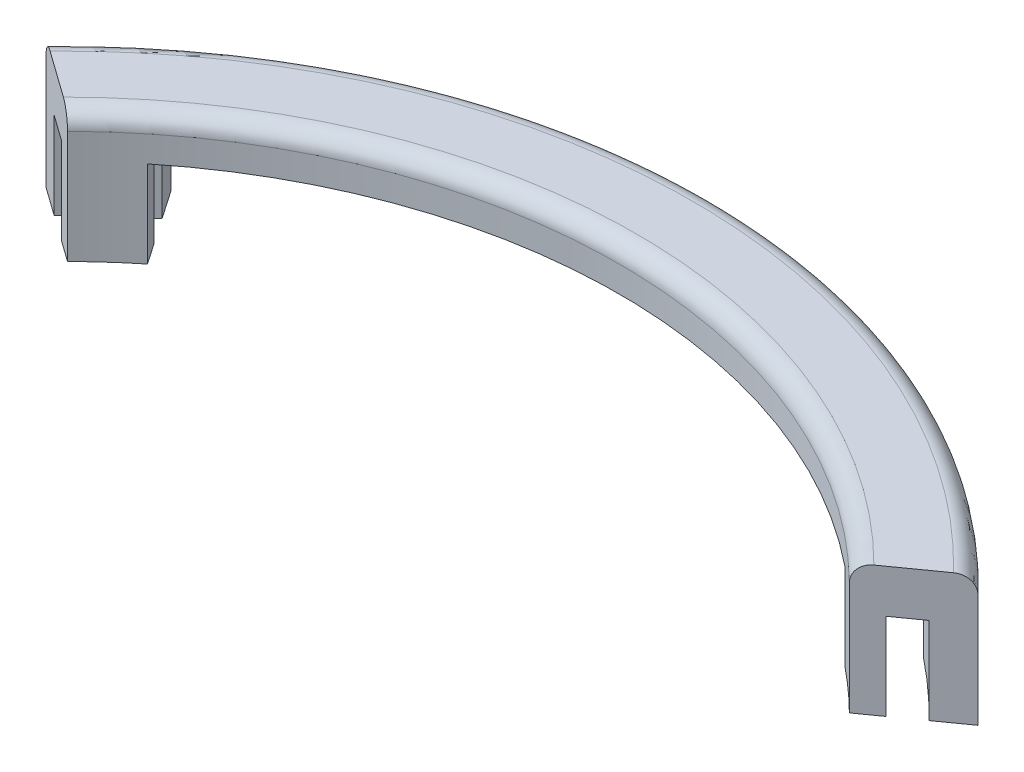
ISO-10303-21;
HEADER;
FILE_DESCRIPTION(('STEP AP214'),'2;1');
FILE_NAME('part.step','',(''),(''),'','','');
FILE_SCHEMA(('AUTOMOTIVE_DESIGN { 1 0 10303 214 1 1 1 1 }'));
ENDSEC;
DATA;
#1=APPLICATION_CONTEXT('core data for automotive mechanical design processes');
#2=APPLICATION_PROTOCOL_DEFINITION('international standard','automotive_design',2000,#1);
#3=PRODUCT_CONTEXT('',#1,'mechanical');
#4=PRODUCT('Part','Part','',(#3));
#5=PRODUCT_RELATED_PRODUCT_CATEGORY('part','',(#4));
#6=PRODUCT_DEFINITION_FORMATION('','',#4);
#7=PRODUCT_DEFINITION_CONTEXT('part definition',#1,'design');
#8=PRODUCT_DEFINITION('design','',#6,#7);
#9=PRODUCT_DEFINITION_SHAPE('','',#8);
#10=(LENGTH_UNIT() NAMED_UNIT(*) SI_UNIT(.MILLI.,.METRE.));
#11=(NAMED_UNIT(*) PLANE_ANGLE_UNIT() SI_UNIT($,.RADIAN.));
#12=(NAMED_UNIT(*) SI_UNIT($,.STERADIAN.) SOLID_ANGLE_UNIT());
#13=UNCERTAINTY_MEASURE_WITH_UNIT(LENGTH_MEASURE(1.E-05),#10,'distance_accuracy_value','');
#14=(GEOMETRIC_REPRESENTATION_CONTEXT(3) GLOBAL_UNCERTAINTY_ASSIGNED_CONTEXT((#13)) GLOBAL_UNIT_ASSIGNED_CONTEXT((#10,
#11,#12)) REPRESENTATION_CONTEXT('',''));
#15=CARTESIAN_POINT('',(0.,0.,0.));
#16=DIRECTION('',(0.,0.,1.));
#17=DIRECTION('',(1.,0.,0.));
#18=AXIS2_PLACEMENT_3D('',#15,#16,#17);
#19=CARTESIAN_POINT('',(0.,0.,0.));
#20=DIRECTION('',(0.,-1.,0.));
#21=DIRECTION('',(0.,0.,-1.));
#22=AXIS2_PLACEMENT_3D('',#19,#20,#21);
#23=PLANE('',#22);
#24=CARTESIAN_POINT('',(0.,0.,0.));
#25=DIRECTION('',(0.,-1.,0.));
#26=DIRECTION('',(0.,0.,-1.));
#27=AXIS2_PLACEMENT_3D('',#24,#25,#26);
#28=CIRCLE('',#27,89.535);
#29=CARTESIAN_POINT('',(55.744972969935,0.,-70.0643576548106));
#30=VERTEX_POINT('',#29);
#31=CARTESIAN_POINT('',(64.0434533645431,0.,-62.569579718451));
#32=VERTEX_POINT('',#31);
#33=EDGE_CURVE('E338',#30,#32,#28,.T.);
#34=ORIENTED_EDGE('',*,*,#33,.F.);
#35=DIRECTION('',(0.566292783903037,0.,-0.824204151226714));
#36=VECTOR('',#35,1.);
#37=CARTESIAN_POINT('',(5.16635721881408,0.,3.54969191519518));
#38=LINE('',#37,#36);
#39=CARTESIAN_POINT('',(58.6284350981099,0.,-74.2610585902647));
#40=VERTEX_POINT('',#39);
#41=EDGE_CURVE('E549',#30,#40,#38,.T.);
#42=ORIENTED_EDGE('',*,*,#41,.T.);
#43=CARTESIAN_POINT('',(0.,0.,0.));
#44=DIRECTION('',(0.,1.,0.));
#45=DIRECTION('',(0.,0.,-1.));
#46=AXIS2_PLACEMENT_3D('',#43,#44,#45);
#47=CIRCLE('',#46,94.615);
#48=CARTESIAN_POINT('',(68.2255935502987,0.,-65.5535400242385));
#49=VERTEX_POINT('',#48);
#50=EDGE_CURVE('E193',#49,#40,#47,.T.);
#51=ORIENTED_EDGE('',*,*,#50,.F.);
#52=DIRECTION('',(0.814035572170162,0.,-0.580815019814052));
#53=VECTOR('',#52,1.);
#54=CARTESIAN_POINT('',(57.2347353310245,0.,-57.7115540562509));
#55=LINE('',#54,#53);
#56=EDGE_CURVE('E213',#32,#49,#55,.T.);
#57=ORIENTED_EDGE('',*,*,#56,.F.);
#58=EDGE_LOOP('',(#34,#42,#51,#57));
#59=FACE_BOUND('',#58,.T.);
#60=ADVANCED_FACE('F38',(#59),#23,.T.);
#61=CARTESIAN_POINT('',(-58.6284350981098,0.,-74.2610585902647));
#62=VERTEX_POINT('',#61);
#63=CARTESIAN_POINT('',(-68.2255935502987,0.,-65.5535400242385));
#64=VERTEX_POINT('',#63);
#65=EDGE_CURVE('E181',#62,#64,#47,.T.);
#66=ORIENTED_EDGE('',*,*,#65,.F.);
#67=DIRECTION('',(0.566292783903031,0.,0.824204151226719));
#68=VECTOR('',#67,1.);
#69=CARTESIAN_POINT('',(-5.16635721881463,0.,3.5496919151955));
#70=LINE('',#69,#68);
#71=CARTESIAN_POINT('',(-55.7449729699349,0.,-70.0643576548106));
#72=VERTEX_POINT('',#71);
#73=EDGE_CURVE('E162',#62,#72,#70,.T.);
#74=ORIENTED_EDGE('',*,*,#73,.T.);
#75=CARTESIAN_POINT('',(-64.0434533645431,0.,-62.569579718451));
#76=VERTEX_POINT('',#75);
#77=EDGE_CURVE('E332',#76,#72,#28,.T.);
#78=ORIENTED_EDGE('',*,*,#77,.F.);
#79=DIRECTION('',(0.814035572170162,0.,0.580815019814052));
#80=VECTOR('',#79,1.);
#81=CARTESIAN_POINT('',(-57.2347353310245,0.,-57.7115540562509));
#82=LINE('',#81,#80);
#83=EDGE_CURVE('E191',#64,#76,#82,.T.);
#84=ORIENTED_EDGE('',*,*,#83,.F.);
#85=EDGE_LOOP('',(#66,#74,#78,#84));
#86=FACE_BOUND('',#85,.T.);
#87=ADVANCED_FACE('F189',(#86),#23,.T.);
#88=CARTESIAN_POINT('',(0.,19.05,0.));
#89=DIRECTION('',(0.,-1.,0.));
#90=DIRECTION('',(0.,0.,-1.));
#91=AXIS2_PLACEMENT_3D('',#88,#89,#90);
#92=CYLINDRICAL_SURFACE('',#91,94.615);
#93=DIRECTION('',(0.,-1.,0.));
#94=VECTOR('',#93,1.);
#95=CARTESIAN_POINT('',(58.6284350981099,19.05,-74.2610585902647));
#96=LINE('',#95,#94);
#97=CARTESIAN_POINT('',(58.6284350981099,12.7,-74.2610585902647));
#98=VERTEX_POINT('',#97);
#99=EDGE_CURVE('E391',#98,#40,#96,.T.);
#100=ORIENTED_EDGE('',*,*,#99,.F.);
#101=CARTESIAN_POINT('',(0.,12.7,0.));
#102=DIRECTION('',(0.,1.,0.));
#103=DIRECTION('',(0.,0.,1.));
#104=AXIS2_PLACEMENT_3D('',#101,#102,#103);
#105=CIRCLE('',#104,94.615);
#106=CARTESIAN_POINT('',(-58.6284350981098,12.7,-74.2610585902647));
#107=VERTEX_POINT('',#106);
#108=EDGE_CURVE('E183',#98,#107,#105,.T.);
#109=ORIENTED_EDGE('',*,*,#108,.T.);
#110=DIRECTION('',(0.,-1.,0.));
#111=VECTOR('',#110,1.);
#112=CARTESIAN_POINT('',(-58.6284350981098,19.05,-74.2610585902647));
#113=LINE('',#112,#111);
#114=EDGE_CURVE('E165',#62,#107,#113,.F.);
#115=ORIENTED_EDGE('',*,*,#114,.F.);
#116=ORIENTED_EDGE('',*,*,#65,.T.);
#117=DIRECTION('',(0.,-1.,0.));
#118=VECTOR('',#117,1.);
#119=CARTESIAN_POINT('',(-68.2255935502987,19.05,-65.5535400242385));
#120=LINE('',#119,#118);
#121=CARTESIAN_POINT('',(-68.2255935502987,16.51,-65.5535400242385));
#122=VERTEX_POINT('',#121);
#123=EDGE_CURVE('E229',#122,#64,#120,.T.);
#124=ORIENTED_EDGE('',*,*,#123,.F.);
#125=CARTESIAN_POINT('',(0.,16.51,0.));
#126=DIRECTION('',(0.,-1.,0.));
#127=DIRECTION('',(0.,0.,-1.));
#128=AXIS2_PLACEMENT_3D('',#125,#126,#127);
#129=CIRCLE('',#128,94.615);
#130=CARTESIAN_POINT('',(68.2255935502987,16.51,-65.5535400242385));
#131=VERTEX_POINT('',#130);
#132=EDGE_CURVE('E11',#122,#131,#129,.T.);
#133=ORIENTED_EDGE('',*,*,#132,.T.);
#134=DIRECTION('',(0.,-1.,0.));
#135=VECTOR('',#134,1.);
#136=CARTESIAN_POINT('',(68.2255935502987,19.05,-65.5535400242385));
#137=LINE('',#136,#135);
#138=EDGE_CURVE('E219',#131,#49,#137,.T.);
#139=ORIENTED_EDGE('',*,*,#138,.T.);
#140=ORIENTED_EDGE('',*,*,#50,.T.);
#141=EDGE_LOOP('',(#100,#109,#115,#116,#124,#133,#139,#140));
#142=FACE_BOUND('',#141,.T.);
#143=ADVANCED_FACE('F179',(#142),#92,.T.);
#144=CARTESIAN_POINT('',(0.,19.05,0.));
#145=DIRECTION('',(0.,-1.,0.));
#146=DIRECTION('',(0.,0.,-1.));
#147=AXIS2_PLACEMENT_3D('',#144,#145,#146);
#148=CYLINDRICAL_SURFACE('',#147,81.28);
#149=DIRECTION('',(0.,-1.,0.));
#150=VECTOR('',#149,1.);
#151=CARTESIAN_POINT('',(51.0575547917866,19.05,-63.242110169441));
#152=LINE('',#151,#150);
#153=CARTESIAN_POINT('',(51.0575547917866,0.,-63.242110169441));
#154=VERTEX_POINT('',#153);
#155=CARTESIAN_POINT('',(51.0575547917866,12.7,-63.242110169441));
#156=VERTEX_POINT('',#155);
#157=EDGE_CURVE('E388',#154,#156,#152,.F.);
#158=ORIENTED_EDGE('',*,*,#157,.F.);
#159=CARTESIAN_POINT('',(0.,0.,0.));
#160=DIRECTION('',(0.,-1.,0.));
#161=DIRECTION('',(0.,0.,-1.));
#162=AXIS2_PLACEMENT_3D('',#159,#160,#161);
#163=CIRCLE('',#162,81.28);
#164=CARTESIAN_POINT('',(57.2347353310245,0.,-57.711554056251));
#165=VERTEX_POINT('',#164);
#166=EDGE_CURVE('E208',#154,#165,#163,.T.);
#167=ORIENTED_EDGE('',*,*,#166,.T.);
#168=DIRECTION('',(0.,-1.,0.));
#169=VECTOR('',#168,1.);
#170=CARTESIAN_POINT('',(57.2347353310245,19.05,-57.711554056251));
#171=LINE('',#170,#169);
#172=CARTESIAN_POINT('',(57.2347353310245,16.51,-57.711554056251));
#173=VERTEX_POINT('',#172);
#174=EDGE_CURVE('E222',#173,#165,#171,.T.);
#175=ORIENTED_EDGE('',*,*,#174,.F.);
#176=CARTESIAN_POINT('',(0.,16.51,0.));
#177=DIRECTION('',(0.,-1.,0.));
#178=DIRECTION('',(0.,0.,-1.));
#179=AXIS2_PLACEMENT_3D('',#176,#177,#178);
#180=CIRCLE('',#179,81.28);
#181=CARTESIAN_POINT('',(-57.2347353310245,16.51,-57.7115540562509));
#182=VERTEX_POINT('',#181);
#183=EDGE_CURVE('E363',#173,#182,#180,.F.);
#184=ORIENTED_EDGE('',*,*,#183,.T.);
#185=DIRECTION('',(0.,-1.,0.));
#186=VECTOR('',#185,1.);
#187=CARTESIAN_POINT('',(-57.2347353310245,19.05,-57.7115540562509));
#188=LINE('',#187,#186);
#189=CARTESIAN_POINT('',(-57.2347353310245,0.,-57.7115540562509));
#190=VERTEX_POINT('',#189);
#191=EDGE_CURVE('E226',#182,#190,#188,.T.);
#192=ORIENTED_EDGE('',*,*,#191,.T.);
#193=CARTESIAN_POINT('',(-51.0575547917866,0.,-63.242110169441));
#194=VERTEX_POINT('',#193);
#195=EDGE_CURVE('E209',#190,#194,#163,.T.);
#196=ORIENTED_EDGE('',*,*,#195,.T.);
#197=DIRECTION('',(0.,-1.,0.));
#198=VECTOR('',#197,1.);
#199=CARTESIAN_POINT('',(-51.0575547917866,19.05,-63.242110169441));
#200=LINE('',#199,#198);
#201=CARTESIAN_POINT('',(-51.0575547917866,12.7,-63.242110169441));
#202=VERTEX_POINT('',#201);
#203=EDGE_CURVE('E186',#202,#194,#200,.T.);
#204=ORIENTED_EDGE('',*,*,#203,.F.);
#205=CARTESIAN_POINT('',(0.,12.7,0.));
#206=DIRECTION('',(0.,1.,0.));
#207=DIRECTION('',(0.,0.,1.));
#208=AXIS2_PLACEMENT_3D('',#205,#206,#207);
#209=CIRCLE('',#208,81.28);
#210=EDGE_CURVE('E374',#202,#156,#209,.F.);
#211=ORIENTED_EDGE('',*,*,#210,.T.);
#212=EDGE_LOOP('',(#158,#167,#175,#184,#192,#196,#204,#211));
#213=FACE_BOUND('',#212,.T.);
#214=ADVANCED_FACE('F263',(#213),#148,.F.);
#215=ORIENTED_EDGE('',*,*,#166,.F.);
#216=CARTESIAN_POINT('',(53.2212853213504,0.,-66.3912862410679));
#217=VERTEX_POINT('',#216);
#218=EDGE_CURVE('E554',#154,#217,#38,.T.);
#219=ORIENTED_EDGE('',*,*,#218,.T.);
#220=CARTESIAN_POINT('',(0.,0.,0.));
#221=DIRECTION('',(0.,1.,0.));
#222=DIRECTION('',(0.,0.,-1.));
#223=AXIS2_PLACEMENT_3D('',#220,#221,#222);
#224=CIRCLE('',#223,85.09);
#225=CARTESIAN_POINT('',(60.3794057355664,0.,-59.9552788586615));
#226=VERTEX_POINT('',#225);
#227=EDGE_CURVE('E331',#226,#217,#224,.T.);
#228=ORIENTED_EDGE('',*,*,#227,.F.);
#229=EDGE_CURVE('E214',#165,#226,#55,.T.);
#230=ORIENTED_EDGE('',*,*,#229,.F.);
#231=EDGE_LOOP('',(#215,#219,#228,#230));
#232=FACE_BOUND('',#231,.T.);
#233=ADVANCED_FACE('F267',(#232),#23,.T.);
#234=CARTESIAN_POINT('',(-53.2212853213504,0.,-66.3912862410679));
#235=VERTEX_POINT('',#234);
#236=CARTESIAN_POINT('',(-60.3794057355663,0.,-59.9552788586615));
#237=VERTEX_POINT('',#236);
#238=EDGE_CURVE('E323',#235,#237,#224,.T.);
#239=ORIENTED_EDGE('',*,*,#238,.F.);
#240=EDGE_CURVE('E174',#235,#194,#70,.T.);
#241=ORIENTED_EDGE('',*,*,#240,.T.);
#242=ORIENTED_EDGE('',*,*,#195,.F.);
#243=EDGE_CURVE('E199',#237,#190,#82,.T.);
#244=ORIENTED_EDGE('',*,*,#243,.F.);
#245=EDGE_LOOP('',(#239,#241,#242,#244));
#246=FACE_BOUND('',#245,.T.);
#247=ADVANCED_FACE('F303',(#246),#23,.T.);
#248=CARTESIAN_POINT('',(0.,12.7,0.));
#249=DIRECTION('',(0.,-1.,0.));
#250=DIRECTION('',(0.,0.,-1.));
#251=AXIS2_PLACEMENT_3D('',#248,#249,#250);
#252=CYLINDRICAL_SURFACE('',#251,89.535);
#253=DIRECTION('',(0.,-1.,0.));
#254=VECTOR('',#253,1.);
#255=CARTESIAN_POINT('',(55.744972969935,12.7,-70.0643576548106));
#256=LINE('',#255,#254);
#257=CARTESIAN_POINT('',(55.744972969935,12.7,-70.0643576548106));
#258=VERTEX_POINT('',#257);
#259=EDGE_CURVE('E385',#30,#258,#256,.F.);
#260=ORIENTED_EDGE('',*,*,#259,.F.);
#261=ORIENTED_EDGE('',*,*,#33,.T.);
#262=DIRECTION('',(0.,-1.,0.));
#263=VECTOR('',#262,1.);
#264=CARTESIAN_POINT('',(64.0434533645431,12.7,-62.569579718451));
#265=LINE('',#264,#263);
#266=CARTESIAN_POINT('',(64.0434533645431,12.7,-62.569579718451));
#267=VERTEX_POINT('',#266);
#268=EDGE_CURVE('E347',#267,#32,#265,.T.);
#269=ORIENTED_EDGE('',*,*,#268,.F.);
#270=CARTESIAN_POINT('',(0.,12.7,0.));
#271=DIRECTION('',(0.,-1.,0.));
#272=DIRECTION('',(0.,0.,-1.));
#273=AXIS2_PLACEMENT_3D('',#270,#271,#272);
#274=CIRCLE('',#273,89.535);
#275=EDGE_CURVE('E337',#258,#267,#274,.T.);
#276=ORIENTED_EDGE('',*,*,#275,.F.);
#277=EDGE_LOOP('',(#260,#261,#269,#276));
#278=FACE_BOUND('',#277,.T.);
#279=ADVANCED_FACE('F310',(#278),#252,.F.);
#280=DIRECTION('',(0.,-1.,0.));
#281=VECTOR('',#280,1.);
#282=CARTESIAN_POINT('',(-55.7449729699349,12.7,-70.0643576548106));
#283=LINE('',#282,#281);
#284=CARTESIAN_POINT('',(-55.744972969935,12.7,-70.0643576548107));
#285=VERTEX_POINT('',#284);
#286=EDGE_CURVE('E168',#285,#72,#283,.T.);
#287=ORIENTED_EDGE('',*,*,#286,.F.);
#288=CARTESIAN_POINT('',(-64.0434533645431,12.7,-62.569579718451));
#289=VERTEX_POINT('',#288);
#290=EDGE_CURVE('E398',#289,#285,#274,.T.);
#291=ORIENTED_EDGE('',*,*,#290,.F.);
#292=DIRECTION('',(0.,-1.,0.));
#293=VECTOR('',#292,1.);
#294=CARTESIAN_POINT('',(-64.0434533645431,12.7,-62.569579718451));
#295=LINE('',#294,#293);
#296=EDGE_CURVE('E194',#289,#76,#295,.T.);
#297=ORIENTED_EDGE('',*,*,#296,.T.);
#298=ORIENTED_EDGE('',*,*,#77,.T.);
#299=EDGE_LOOP('',(#287,#291,#297,#298));
#300=FACE_BOUND('',#299,.T.);
#301=ADVANCED_FACE('F316',(#300),#252,.F.);
#302=CARTESIAN_POINT('',(0.,12.7,0.));
#303=DIRECTION('',(0.,-1.,0.));
#304=DIRECTION('',(0.,0.,-1.));
#305=AXIS2_PLACEMENT_3D('',#302,#303,#304);
#306=CYLINDRICAL_SURFACE('',#305,85.09);
#307=DIRECTION('',(0.,-1.,0.));
#308=VECTOR('',#307,1.);
#309=CARTESIAN_POINT('',(53.2212853213504,12.7,-66.3912862410679));
#310=LINE('',#309,#308);
#311=CARTESIAN_POINT('',(53.2212853213504,12.7,-66.3912862410679));
#312=VERTEX_POINT('',#311);
#313=EDGE_CURVE('E185',#312,#217,#310,.T.);
#314=ORIENTED_EDGE('',*,*,#313,.F.);
#315=CARTESIAN_POINT('',(0.,12.7,0.));
#316=DIRECTION('',(0.,1.,0.));
#317=DIRECTION('',(0.,0.,-1.));
#318=AXIS2_PLACEMENT_3D('',#315,#316,#317);
#319=CIRCLE('',#318,85.09);
#320=CARTESIAN_POINT('',(60.3794057355663,12.7,-59.9552788586615));
#321=VERTEX_POINT('',#320);
#322=EDGE_CURVE('E407',#321,#312,#319,.T.);
#323=ORIENTED_EDGE('',*,*,#322,.F.);
#324=DIRECTION('',(0.,-1.,0.));
#325=VECTOR('',#324,1.);
#326=CARTESIAN_POINT('',(60.3794057355663,12.7,-59.9552788586615));
#327=LINE('',#326,#325);
#328=EDGE_CURVE('E344',#321,#226,#327,.T.);
#329=ORIENTED_EDGE('',*,*,#328,.T.);
#330=ORIENTED_EDGE('',*,*,#227,.T.);
#331=EDGE_LOOP('',(#314,#323,#329,#330));
#332=FACE_BOUND('',#331,.T.);
#333=ADVANCED_FACE('F417',(#332),#306,.T.);
#334=DIRECTION('',(0.,-1.,0.));
#335=VECTOR('',#334,1.);
#336=CARTESIAN_POINT('',(-53.2212853213504,12.7,-66.3912862410679));
#337=LINE('',#336,#335);
#338=CARTESIAN_POINT('',(-53.2212853213504,12.7,-66.3912862410679));
#339=VERTEX_POINT('',#338);
#340=EDGE_CURVE('E379',#235,#339,#337,.F.);
#341=ORIENTED_EDGE('',*,*,#340,.F.);
#342=ORIENTED_EDGE('',*,*,#238,.T.);
#343=DIRECTION('',(0.,-1.,0.));
#344=VECTOR('',#343,1.);
#345=CARTESIAN_POINT('',(-60.3794057355663,12.7,-59.9552788586615));
#346=LINE('',#345,#344);
#347=CARTESIAN_POINT('',(-60.3794057355663,12.7,-59.9552788586615));
#348=VERTEX_POINT('',#347);
#349=EDGE_CURVE('E200',#348,#237,#346,.T.);
#350=ORIENTED_EDGE('',*,*,#349,.F.);
#351=EDGE_CURVE('E406',#339,#348,#319,.T.);
#352=ORIENTED_EDGE('',*,*,#351,.F.);
#353=EDGE_LOOP('',(#341,#342,#350,#352));
#354=FACE_BOUND('',#353,.T.);
#355=ADVANCED_FACE('F272',(#354),#306,.T.);
#356=CARTESIAN_POINT('',(-57.2347353310245,19.05,-57.7115540562509));
#357=DIRECTION('',(0.580815019814052,0.,-0.814035572170162));
#358=DIRECTION('',(-0.814035572170162,0.,-0.580815019814052));
#359=AXIS2_PLACEMENT_3D('',#356,#357,#358);
#360=PLANE('',#359);
#361=ORIENTED_EDGE('',*,*,#191,.F.);
#362=CARTESIAN_POINT('',(-57.2347353310245,16.51,-57.7115540562509));
#363=CARTESIAN_POINT('',(-57.2347292125334,16.5807027289296,-57.7115496907027));
#364=CARTESIAN_POINT('',(-57.237173461785,16.6514018811038,-57.7132936644626));
#365=CARTESIAN_POINT('',(-57.2469154589435,16.7922884303876,-57.7202445870833));
#366=CARTESIAN_POINT('',(-57.2542128303198,16.8624758667718,-57.7254512672892));
#367=CARTESIAN_POINT('',(-57.2736025490014,17.0017643360062,-57.7392858467908));
#368=CARTESIAN_POINT('',(-57.2856893010382,17.0708665391062,-57.7479097538579));
#369=CARTESIAN_POINT('',(-57.3145521117735,17.2075564949376,-57.7685033919767));
#370=CARTESIAN_POINT('',(-57.331328139965,17.2751442575184,-57.7804731012616));
#371=CARTESIAN_POINT('',(-57.3885344369747,17.4749666658083,-57.8212898390886));
#372=CARTESIAN_POINT('',(-57.4358538106855,17.6043381113576,-57.8550522493801));
#373=CARTESIAN_POINT('',(-57.5473638490288,17.8514867100328,-57.9346147492806));
#374=CARTESIAN_POINT('',(-57.6115535330716,17.969264536493,-57.9804141392382));
#375=CARTESIAN_POINT('',(-57.7553907269823,18.1908514799067,-58.0830420900151));
#376=CARTESIAN_POINT('',(-57.8351345444467,18.2945663658334,-58.1399393663799));
#377=CARTESIAN_POINT('',(-58.0075094791364,18.4843585711963,-58.2629290176065));
#378=CARTESIAN_POINT('',(-58.1001434481603,18.5704319772076,-58.3290234272288));
#379=CARTESIAN_POINT('',(-58.297004126405,18.7237328887879,-58.4694836757047));
#380=CARTESIAN_POINT('',(-58.4013722475935,18.7906861021638,-58.5439504121084));
#381=CARTESIAN_POINT('',(-58.6176848437346,18.9023906695845,-58.6982896192745));
#382=CARTESIAN_POINT('',(-58.7296262860345,18.9471508514795,-58.7781599262368));
#383=CARTESIAN_POINT('',(-58.9236696217515,19.0034225981474,-58.9166099986074));
#384=CARTESIAN_POINT('',(-59.0046645237337,19.0208776014887,-58.974399924758));
#385=CARTESIAN_POINT('',(-59.1676387969249,19.0441658601325,-59.0906821966253));
#386=CARTESIAN_POINT('',(-59.2496166306025,19.0500153566809,-59.1491734453122));
#387=CARTESIAN_POINT('',(-59.33162764036,19.05,-59.2076883651581));
#388=B_SPLINE_CURVE_WITH_KNOTS('',3,(#362,#363,#364,#365,#366,#367,#368,#369,#370,#371,#372,
#373,#374,#375,#376,#377,#378,#379,#380,#381,#382,#383,#384,#385,#386,#387),.UNSPECIFIED.,.F.,
.F.,(4,2,2,2,2,2,2,2,2,2,2,2,4),(0.,0.212038091459266,0.424059733814965,0.635834405439172,
0.84760769935326,1.27092079623805,1.69420929341764,2.12020703134357,2.54629916668803,
2.97822772417059,3.40998433282428,3.71239781108664,4.01438777954809),.UNSPECIFIED.);
#389=CARTESIAN_POINT('',(-59.33162764036,19.05,-59.2076883651581));
#390=VERTEX_POINT('',#389);
#391=EDGE_CURVE('E48',#182,#390,#388,.T.);
#392=ORIENTED_EDGE('',*,*,#391,.T.);
#393=DIRECTION('',(0.814035572170162,0.,0.580815019814052));
#394=VECTOR('',#393,1.);
#395=CARTESIAN_POINT('',(-57.2347353310245,19.05,-57.7115540562509));
#396=LINE('',#395,#394);
#397=CARTESIAN_POINT('',(-66.135180534394,19.05,-64.0620286962809));
#398=VERTEX_POINT('',#397);
#399=EDGE_CURVE('E218',#398,#390,#396,.T.);
#400=ORIENTED_EDGE('',*,*,#399,.F.);
#401=CARTESIAN_POINT('',(-66.135180534394,19.05,-64.0620286962809));
#402=CARTESIAN_POINT('',(-66.1944766345441,19.0499990825189,-64.1043365102894));
#403=CARTESIAN_POINT('',(-66.2537445496103,19.0469343988423,-64.1466242142182));
#404=CARTESIAN_POINT('',(-66.3718602879345,19.0347041977518,-64.230899886241));
#405=CARTESIAN_POINT('',(-66.4307081207936,19.0255388202253,-64.2728878611854));
#406=CARTESIAN_POINT('',(-66.60592574606,18.9889636862598,-64.3979057743701));
#407=CARTESIAN_POINT('',(-66.7211280670028,18.9524747643107,-64.4801027208041));
#408=CARTESIAN_POINT('',(-66.944916393503,18.8562241883581,-64.6397758674503));
#409=CARTESIAN_POINT('',(-67.0534983635128,18.796448500339,-64.7172491882962));
#410=CARTESIAN_POINT('',(-67.2608804153753,18.6552441228344,-64.8652164451084));
#411=CARTESIAN_POINT('',(-67.3596831639858,18.5738213588759,-64.9357122838086));
#412=CARTESIAN_POINT('',(-67.5441121893266,18.3920493313781,-65.0673025381779));
#413=CARTESIAN_POINT('',(-67.6298062095813,18.2918037815529,-65.128445288905));
#414=CARTESIAN_POINT('',(-67.7861215462134,18.074869035856,-65.2399764043097));
#415=CARTESIAN_POINT('',(-67.8567402340852,17.9581769782823,-65.2903628935465));
#416=CARTESIAN_POINT('',(-67.9800986166503,17.712978258467,-65.378379196351));
#417=CARTESIAN_POINT('',(-68.0330138578835,17.5846047019455,-65.4161342625127));
#418=CARTESIAN_POINT('',(-68.1203252283969,17.3187268271553,-65.4784309939192));
#419=CARTESIAN_POINT('',(-68.1547350577661,17.1812293485447,-65.502982434188));
#420=CARTESIAN_POINT('',(-68.1947373250157,16.9539576725633,-65.531524083275));
#421=CARTESIAN_POINT('',(-68.2063016752937,16.8657030757747,-65.5397752562771));
#422=CARTESIAN_POINT('',(-68.2217280877653,16.6883122843,-65.5507820136863));
#423=CARTESIAN_POINT('',(-68.2256011816788,16.59917753685,-65.5535454692343));
#424=CARTESIAN_POINT('',(-68.2255935502987,16.51,-65.5535400242385));
#425=B_SPLINE_CURVE_WITH_KNOTS('',3,(#401,#402,#403,#404,#405,#406,#407,#408,#409,#410,#411,
#412,#413,#414,#415,#416,#417,#418,#419,#420,#421,#422,#423,#424),.UNSPECIFIED.,.F.,.F.,(4,2,2,
2,2,2,2,2,2,2,2,4),(0.,0.218393054742541,0.436781101963117,0.872980821932522,1.3094438299623,
1.74578748629325,2.17979391786544,2.61387596025898,3.04351642178407,3.47283836871294,
3.74054492114632,4.00786721867657),.UNSPECIFIED.);
#426=EDGE_CURVE('E276',#398,#122,#425,.T.);
#427=ORIENTED_EDGE('',*,*,#426,.T.);
#428=ORIENTED_EDGE('',*,*,#123,.T.);
#429=ORIENTED_EDGE('',*,*,#83,.T.);
#430=ORIENTED_EDGE('',*,*,#296,.F.);
#431=DIRECTION('',(-0.814035572170162,0.,-0.580815019814051));
#432=VECTOR('',#431,1.);
#433=CARTESIAN_POINT('',(-60.3794057355663,12.7,-59.9552788586615));
#434=LINE('',#433,#432);
#435=EDGE_CURVE('E350',#348,#289,#434,.T.);
#436=ORIENTED_EDGE('',*,*,#435,.F.);
#437=ORIENTED_EDGE('',*,*,#349,.T.);
#438=ORIENTED_EDGE('',*,*,#243,.T.);
#439=EDGE_LOOP('',(#361,#392,#400,#427,#428,#429,#430,#436,#437,#438));
#440=FACE_BOUND('',#439,.T.);
#441=ADVANCED_FACE('F260',(#440),#360,.F.);
#442=CARTESIAN_POINT('',(57.2347353310245,19.05,-57.7115540562509));
#443=DIRECTION('',(-0.580815019814052,0.,-0.814035572170162));
#444=DIRECTION('',(-0.814035572170162,0.,0.580815019814052));
#445=AXIS2_PLACEMENT_3D('',#442,#443,#444);
#446=PLANE('',#445);
#447=DIRECTION('',(0.814035572170162,0.,-0.580815019814052));
#448=VECTOR('',#447,1.);
#449=CARTESIAN_POINT('',(57.2347353310245,19.05,-57.7115540562509));
#450=LINE('',#449,#448);
#451=CARTESIAN_POINT('',(59.33162764036,19.05,-59.2076883651581));
#452=VERTEX_POINT('',#451);
#453=CARTESIAN_POINT('',(66.135180534394,19.05,-64.0620286962809));
#454=VERTEX_POINT('',#453);
#455=EDGE_CURVE('E204',#452,#454,#450,.T.);
#456=ORIENTED_EDGE('',*,*,#455,.F.);
#457=CARTESIAN_POINT('',(59.33162764036,19.05,-59.207688365158));
#458=CARTESIAN_POINT('',(59.2720307100916,19.0499989865762,-59.1651659086241));
#459=CARTESIAN_POINT('',(59.2124622206863,19.0469178037369,-59.1226637446683));
#460=CARTESIAN_POINT('',(59.0937476134898,19.0346234586212,-59.0379607792349));
#461=CARTESIAN_POINT('',(59.0346014854869,19.025410445108,-58.9957599704713));
#462=CARTESIAN_POINT('',(58.8584898007428,18.9886471361571,-58.8701041451474));
#463=CARTESIAN_POINT('',(58.7426976591911,18.9519724062892,-58.7874863612459));
#464=CARTESIAN_POINT('',(58.5177626514951,18.8552341443721,-58.6269950566663));
#465=CARTESIAN_POINT('',(58.4086238022919,18.795156641457,-58.5491244020787));
#466=CARTESIAN_POINT('',(58.2001833849622,18.6532254801437,-58.4004020006748));
#467=CARTESIAN_POINT('',(58.1008790762764,18.5713779119044,-58.3295482984671));
#468=CARTESIAN_POINT('',(57.9155953314868,18.3886800555013,-58.1973482011));
#469=CARTESIAN_POINT('',(57.8295401492133,18.287945696252,-58.135947760989));
#470=CARTESIAN_POINT('',(57.6726233060894,18.0699187749397,-58.0239874702301));
#471=CARTESIAN_POINT('',(57.6017641295827,17.9526235105804,-57.9734293921636));
#472=CARTESIAN_POINT('',(57.4782780315429,17.7064784967689,-57.8853219642676));
#473=CARTESIAN_POINT('',(57.4254250990078,17.5777996406921,-57.8476113554108));
#474=CARTESIAN_POINT('',(57.3383527924462,17.311304206886,-57.7854851963218));
#475=CARTESIAN_POINT('',(57.3041186439895,17.1734949720303,-57.7610591045219));
#476=CARTESIAN_POINT('',(57.2647700616797,16.9472164663215,-57.7329838601526));
#477=CARTESIAN_POINT('',(57.2535136785064,16.8602885545611,-57.7249524219215));
#478=CARTESIAN_POINT('',(57.2384981000984,16.6855871758799,-57.7142387949392));
#479=CARTESIAN_POINT('',(57.2347281972873,16.5978150972714,-57.7115489663238));
#480=CARTESIAN_POINT('',(57.2347353310245,16.51,-57.7115540562509));
#481=B_SPLINE_CURVE_WITH_KNOTS('',3,(#457,#458,#459,#460,#461,#462,#463,#464,#465,#466,#467,
#468,#469,#470,#471,#472,#473,#474,#475,#476,#477,#478,#479,#480),.UNSPECIFIED.,.F.,.F.,(4,2,2,
2,2,2,2,2,2,2,2,4),(0.,0.219500808583012,0.43899629209008,0.877429504633983,1.31612485286171,
1.75469760524803,2.19066161547289,2.62669684574215,3.05703788848829,3.48703694569282,
3.75065357208347,4.01389288712502),.UNSPECIFIED.);
#482=EDGE_CURVE('E248',#452,#173,#481,.T.);
#483=ORIENTED_EDGE('',*,*,#482,.T.);
#484=ORIENTED_EDGE('',*,*,#174,.T.);
#485=ORIENTED_EDGE('',*,*,#229,.T.);
#486=ORIENTED_EDGE('',*,*,#328,.F.);
#487=DIRECTION('',(-0.814035572170164,0.,0.580815019814049));
#488=VECTOR('',#487,1.);
#489=CARTESIAN_POINT('',(64.0434533645431,12.7,-62.569579718451));
#490=LINE('',#489,#488);
#491=EDGE_CURVE('E402',#267,#321,#490,.T.);
#492=ORIENTED_EDGE('',*,*,#491,.F.);
#493=ORIENTED_EDGE('',*,*,#268,.T.);
#494=ORIENTED_EDGE('',*,*,#56,.T.);
#495=ORIENTED_EDGE('',*,*,#138,.F.);
#496=CARTESIAN_POINT('',(68.2255935502987,16.51,-65.5535400242385));
#497=CARTESIAN_POINT('',(68.2255995007909,16.580887602523,-65.5535442699194));
#498=CARTESIAN_POINT('',(68.2231520299304,16.6517717319816,-65.551797997539));
#499=CARTESIAN_POINT('',(68.2133962144063,16.793028678911,-65.5448372155036));
#500=CARTESIAN_POINT('',(68.2060882034256,16.8634015311466,-65.5396229439316));
#501=CARTESIAN_POINT('',(68.1866674448129,17.0030682164127,-65.5257662174149));
#502=CARTESIAN_POINT('',(68.174559739665,17.0723631027894,-65.5171273602866));
#503=CARTESIAN_POINT('',(68.1456431584469,17.2094358711854,-65.496495356886));
#504=CARTESIAN_POINT('',(68.1288343212423,17.277213765741,-65.4845022383445));
#505=CARTESIAN_POINT('',(68.0715060803796,17.4776060035202,-65.4435984934826));
#506=CARTESIAN_POINT('',(68.0240749294032,17.6073504658334,-65.4097563300245));
#507=CARTESIAN_POINT('',(67.9122617261247,17.8551887018224,-65.3299775217046));
#508=CARTESIAN_POINT('',(67.8478812557475,17.9732835613731,-65.2840420055476));
#509=CARTESIAN_POINT('',(67.703700136525,18.1952004091384,-65.1811686637909));
#510=CARTESIAN_POINT('',(67.6238304365488,18.2989547810467,-65.124181570155));
#511=CARTESIAN_POINT('',(67.4511565751371,18.4887314470089,-65.0009786344776));
#512=CARTESIAN_POINT('',(67.3583496790741,18.5747499825575,-64.9347608412772));
#513=CARTESIAN_POINT('',(67.1614456136045,18.7275363459483,-64.7942696359822));
#514=CARTESIAN_POINT('',(67.0572426329645,18.7940981827114,-64.7199207274895));
#515=CARTESIAN_POINT('',(66.8412966894481,18.9050007897097,-64.5658431272589));
#516=CARTESIAN_POINT('',(66.7295569668992,18.9493510413056,-64.4861167474974));
#517=CARTESIAN_POINT('',(66.5369209599593,19.0046164717056,-64.3486708053141));
#518=CARTESIAN_POINT('',(66.4571460328771,19.0216257816651,-64.2917513322124));
#519=CARTESIAN_POINT('',(66.2966508857626,19.0443168056145,-64.1772379187472));
#520=CARTESIAN_POINT('',(66.2159321722055,19.0500146022591,-64.1196450532547));
#521=CARTESIAN_POINT('',(66.135180534394,19.05,-64.0620286962809));
#522=B_SPLINE_CURVE_WITH_KNOTS('',3,(#496,#497,#498,#499,#500,#501,#502,#503,#504,#505,#506,
#507,#508,#509,#510,#511,#512,#513,#514,#515,#516,#517,#518,#519,#520,#521),.UNSPECIFIED.,.F.,
.F.,(4,2,2,2,2,2,2,2,2,2,2,2,4),(0.,0.212592870191641,0.425171147091959,0.637526681931899,
0.849880461216148,1.27437291793105,1.6988257696759,2.12521623882518,2.55169697422522,
2.98254170872155,3.41320237335247,3.71098119951669,4.00833634110515),.UNSPECIFIED.);
#523=EDGE_CURVE('E240',#131,#454,#522,.T.);
#524=ORIENTED_EDGE('',*,*,#523,.T.);
#525=EDGE_LOOP('',(#456,#483,#484,#485,#486,#492,#493,#494,#495,#524));
#526=FACE_BOUND('',#525,.T.);
#527=ADVANCED_FACE('F254',(#526),#446,.F.);
#528=CARTESIAN_POINT('',(0.,19.05,0.));
#529=DIRECTION('',(0.,-1.,0.));
#530=DIRECTION('',(0.,0.,-1.));
#531=AXIS2_PLACEMENT_3D('',#528,#529,#530);
#532=PLANE('',#531);
#533=ORIENTED_EDGE('',*,*,#399,.T.);
#534=CARTESIAN_POINT('',(0.,19.05,0.));
#535=DIRECTION('',(0.,-1.,0.));
#536=DIRECTION('',(0.,0.,-1.));
#537=AXIS2_PLACEMENT_3D('',#534,#535,#536);
#538=CIRCLE('',#537,83.82);
#539=EDGE_CURVE('E236',#390,#452,#538,.T.);
#540=ORIENTED_EDGE('',*,*,#539,.T.);
#541=ORIENTED_EDGE('',*,*,#455,.T.);
#542=CARTESIAN_POINT('',(0.,19.05,0.));
#543=DIRECTION('',(0.,-1.,0.));
#544=DIRECTION('',(0.,0.,-1.));
#545=AXIS2_PLACEMENT_3D('',#542,#543,#544);
#546=CIRCLE('',#545,92.075);
#547=EDGE_CURVE('E232',#454,#398,#546,.F.);
#548=ORIENTED_EDGE('',*,*,#547,.T.);
#549=EDGE_LOOP('',(#533,#540,#541,#548));
#550=FACE_BOUND('',#549,.T.);
#551=ADVANCED_FACE('F259',(#550),#532,.F.);
#552=CARTESIAN_POINT('',(0.,12.7,0.));
#553=DIRECTION('',(0.,-1.,0.));
#554=DIRECTION('',(0.,0.,-1.));
#555=AXIS2_PLACEMENT_3D('',#552,#553,#554);
#556=PLANE('',#555);
#557=ORIENTED_EDGE('',*,*,#290,.T.);
#558=DIRECTION('',(0.566292783903031,0.,0.824204151226719));
#559=VECTOR('',#558,1.);
#560=CARTESIAN_POINT('',(-5.16635721881463,12.7,3.5496919151955));
#561=LINE('',#560,#559);
#562=EDGE_CURVE('E577',#107,#285,#561,.T.);
#563=ORIENTED_EDGE('',*,*,#562,.F.);
#564=ORIENTED_EDGE('',*,*,#108,.F.);
#565=DIRECTION('',(0.566292783903037,0.,-0.824204151226714));
#566=VECTOR('',#565,1.);
#567=CARTESIAN_POINT('',(5.16635721881408,12.7,3.54969191519518));
#568=LINE('',#567,#566);
#569=EDGE_CURVE('E62',#258,#98,#568,.T.);
#570=ORIENTED_EDGE('',*,*,#569,.F.);
#571=ORIENTED_EDGE('',*,*,#275,.T.);
#572=ORIENTED_EDGE('',*,*,#491,.T.);
#573=ORIENTED_EDGE('',*,*,#322,.T.);
#574=EDGE_CURVE('E580',#156,#312,#568,.T.);
#575=ORIENTED_EDGE('',*,*,#574,.F.);
#576=ORIENTED_EDGE('',*,*,#210,.F.);
#577=EDGE_CURVE('E55',#339,#202,#561,.T.);
#578=ORIENTED_EDGE('',*,*,#577,.F.);
#579=ORIENTED_EDGE('',*,*,#351,.T.);
#580=ORIENTED_EDGE('',*,*,#435,.T.);
#581=EDGE_LOOP('',(#557,#563,#564,#570,#571,#572,#573,#575,#576,#578,#579,#580));
#582=FACE_BOUND('',#581,.T.);
#583=ADVANCED_FACE('F289',(#582),#556,.T.);
#584=CARTESIAN_POINT('',(0.,16.51,0.));
#585=DIRECTION('',(0.,-1.,0.));
#586=DIRECTION('',(0.,0.,-1.));
#587=AXIS2_PLACEMENT_3D('',#584,#585,#586);
#588=TOROIDAL_SURFACE('',#587,83.82,2.54);
#589=ORIENTED_EDGE('',*,*,#391,.F.);
#590=ORIENTED_EDGE('',*,*,#183,.F.);
#591=ORIENTED_EDGE('',*,*,#482,.F.);
#592=ORIENTED_EDGE('',*,*,#539,.F.);
#593=EDGE_LOOP('',(#589,#590,#591,#592));
#594=FACE_BOUND('',#593,.T.);
#595=ADVANCED_FACE('F286',(#594),#588,.T.);
#596=CARTESIAN_POINT('',(0.,16.51,0.));
#597=DIRECTION('',(0.,-1.,0.));
#598=DIRECTION('',(0.,0.,-1.));
#599=AXIS2_PLACEMENT_3D('',#596,#597,#598);
#600=TOROIDAL_SURFACE('',#599,92.075,2.54);
#601=ORIENTED_EDGE('',*,*,#523,.F.);
#602=ORIENTED_EDGE('',*,*,#132,.F.);
#603=ORIENTED_EDGE('',*,*,#426,.F.);
#604=ORIENTED_EDGE('',*,*,#547,.F.);
#605=EDGE_LOOP('',(#601,#602,#603,#604));
#606=FACE_BOUND('',#605,.T.);
#607=ADVANCED_FACE('F40',(#606),#600,.T.);
#608=CARTESIAN_POINT('',(-5.16635721881463,12.7,3.5496919151955));
#609=DIRECTION('',(0.824204151226719,0.,-0.56629278390303));
#610=DIRECTION('',(-0.56629278390303,0.,-0.824204151226719));
#611=AXIS2_PLACEMENT_3D('',#608,#609,#610);
#612=PLANE('',#611);
#613=ORIENTED_EDGE('',*,*,#203,.T.);
#614=ORIENTED_EDGE('',*,*,#240,.F.);
#615=ORIENTED_EDGE('',*,*,#340,.T.);
#616=ORIENTED_EDGE('',*,*,#577,.T.);
#617=EDGE_LOOP('',(#613,#614,#615,#616));
#618=FACE_BOUND('',#617,.T.);
#619=ADVANCED_FACE('F296',(#618),#612,.T.);
#620=CARTESIAN_POINT('',(5.16635721881408,12.7,3.54969191519518));
#621=DIRECTION('',(-0.824204151226714,0.,-0.566292783903037));
#622=DIRECTION('',(-0.566292783903037,0.,0.824204151226714));
#623=AXIS2_PLACEMENT_3D('',#620,#621,#622);
#624=PLANE('',#623);
#625=ORIENTED_EDGE('',*,*,#157,.T.);
#626=ORIENTED_EDGE('',*,*,#574,.T.);
#627=ORIENTED_EDGE('',*,*,#313,.T.);
#628=ORIENTED_EDGE('',*,*,#218,.F.);
#629=EDGE_LOOP('',(#625,#626,#627,#628));
#630=FACE_BOUND('',#629,.T.);
#631=ADVANCED_FACE('F519',(#630),#624,.T.);
#632=ORIENTED_EDGE('',*,*,#99,.T.);
#633=ORIENTED_EDGE('',*,*,#41,.F.);
#634=ORIENTED_EDGE('',*,*,#259,.T.);
#635=ORIENTED_EDGE('',*,*,#569,.T.);
#636=EDGE_LOOP('',(#632,#633,#634,#635));
#637=FACE_BOUND('',#636,.T.);
#638=ADVANCED_FACE('F525',(#637),#624,.T.);
#639=ORIENTED_EDGE('',*,*,#114,.T.);
#640=ORIENTED_EDGE('',*,*,#562,.T.);
#641=ORIENTED_EDGE('',*,*,#286,.T.);
#642=ORIENTED_EDGE('',*,*,#73,.F.);
#643=EDGE_LOOP('',(#639,#640,#641,#642));
#644=FACE_BOUND('',#643,.T.);
#645=ADVANCED_FACE('F164',(#644),#612,.T.);
#646=CLOSED_SHELL('',(#60,#87,#143,#214,#233,#247,#279,#301,#333,#355,#441,#527,#551,#583,#595,
#607,#619,#631,#638,#645));
#647=MANIFOLD_SOLID_BREP('B2',#646);
#648=ADVANCED_BREP_SHAPE_REPRESENTATION('',(#18,#647),#14);
#649=SHAPE_DEFINITION_REPRESENTATION(#9,#648);
ENDSEC;
END-ISO-10303-21;
